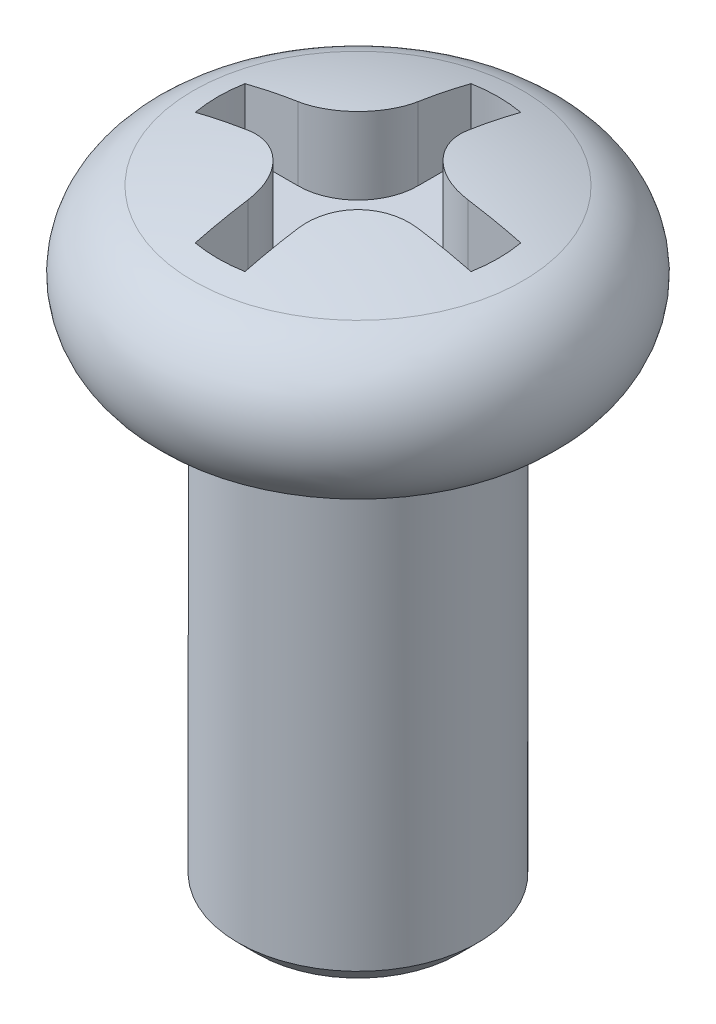
ISO-10303-21;
HEADER;
FILE_DESCRIPTION(('STEP AP214'),'2;1');
FILE_NAME('part.step','',(''),(''),'','','');
FILE_SCHEMA(('AUTOMOTIVE_DESIGN { 1 0 10303 214 1 1 1 1 }'));
ENDSEC;
DATA;
#1=APPLICATION_CONTEXT('core data for automotive mechanical design processes');
#2=APPLICATION_PROTOCOL_DEFINITION('international standard','automotive_design',2000,#1);
#3=PRODUCT_CONTEXT('',#1,'mechanical');
#4=PRODUCT('Part','Part','',(#3));
#5=PRODUCT_RELATED_PRODUCT_CATEGORY('part','',(#4));
#6=PRODUCT_DEFINITION_FORMATION('','',#4);
#7=PRODUCT_DEFINITION_CONTEXT('part definition',#1,'design');
#8=PRODUCT_DEFINITION('design','',#6,#7);
#9=PRODUCT_DEFINITION_SHAPE('','',#8);
#10=(LENGTH_UNIT() NAMED_UNIT(*) SI_UNIT(.MILLI.,.METRE.));
#11=(NAMED_UNIT(*) PLANE_ANGLE_UNIT() SI_UNIT($,.RADIAN.));
#12=(NAMED_UNIT(*) SI_UNIT($,.STERADIAN.) SOLID_ANGLE_UNIT());
#13=UNCERTAINTY_MEASURE_WITH_UNIT(LENGTH_MEASURE(1.E-05),#10,'distance_accuracy_value','');
#14=(GEOMETRIC_REPRESENTATION_CONTEXT(3) GLOBAL_UNCERTAINTY_ASSIGNED_CONTEXT((#13)) GLOBAL_UNIT_ASSIGNED_CONTEXT((#10,
#11,#12)) REPRESENTATION_CONTEXT('',''));
#15=CARTESIAN_POINT('',(0.,0.,0.));
#16=DIRECTION('',(0.,0.,1.));
#17=DIRECTION('',(1.,0.,0.));
#18=AXIS2_PLACEMENT_3D('',#15,#16,#17);
#19=CARTESIAN_POINT('',(0.,1.,0.));
#20=DIRECTION('',(0.,-1.,0.));
#21=DIRECTION('',(0.,0.,-1.));
#22=AXIS2_PLACEMENT_3D('',#19,#20,#21);
#23=PLANE('',#22);
#24=DIRECTION('',(0.,0.,1.));
#25=VECTOR('',#24,1.);
#26=CARTESIAN_POINT('',(-0.3106601717798,1.,1.722205056801));
#27=LINE('',#26,#25);
#28=CARTESIAN_POINT('',(-0.3106601717799,1.,1.06066017178));
#29=VERTEX_POINT('',#28);
#30=CARTESIAN_POINT('',(-0.3106601717798,1.,1.72220505680083));
#31=VERTEX_POINT('',#30);
#32=EDGE_CURVE('P0_E159',#29,#31,#27,.T.);
#33=ORIENTED_EDGE('',*,*,#32,.T.);
#34=CARTESIAN_POINT('',(0.,1.,0.));
#35=DIRECTION('',(0.,-1.,0.));
#36=DIRECTION('',(0.,0.,-1.));
#37=AXIS2_PLACEMENT_3D('',#34,#35,#36);
#38=CIRCLE('',#37,1.75);
#39=CARTESIAN_POINT('',(0.31066017177977,1.,1.72220505680066));
#40=VERTEX_POINT('',#39);
#41=EDGE_CURVE('P0_E231',#31,#40,#38,.F.);
#42=ORIENTED_EDGE('',*,*,#41,.T.);
#43=DIRECTION('',(0.,0.,-1.));
#44=VECTOR('',#43,1.);
#45=CARTESIAN_POINT('',(0.3106601717798,1.,1.06066017178));
#46=LINE('',#45,#44);
#47=CARTESIAN_POINT('',(0.3106601717798,1.,1.06066017178));
#48=VERTEX_POINT('',#47);
#49=EDGE_CURVE('P0_E163',#40,#48,#46,.T.);
#50=ORIENTED_EDGE('',*,*,#49,.T.);
#51=CARTESIAN_POINT('',(1.06066017178,1.,1.06066017178));
#52=DIRECTION('',(0.,-1.,0.));
#53=DIRECTION('',(0.,0.,-1.));
#54=AXIS2_PLACEMENT_3D('',#51,#52,#53);
#55=CIRCLE('',#54,0.75);
#56=CARTESIAN_POINT('',(1.06066017178,1.,0.3106601717799));
#57=VERTEX_POINT('',#56);
#58=EDGE_CURVE('P0_E166',#57,#48,#55,.F.);
#59=ORIENTED_EDGE('',*,*,#58,.F.);
#60=DIRECTION('',(1.,0.,0.));
#61=VECTOR('',#60,1.);
#62=CARTESIAN_POINT('',(1.722205056801,1.,0.3106601717798));
#63=LINE('',#62,#61);
#64=CARTESIAN_POINT('',(1.72220505680083,1.,0.3106601717798));
#65=VERTEX_POINT('',#64);
#66=EDGE_CURVE('P0_E167',#57,#65,#63,.T.);
#67=ORIENTED_EDGE('',*,*,#66,.T.);
#68=CARTESIAN_POINT('',(0.,1.,0.));
#69=DIRECTION('',(0.,-1.,0.));
#70=DIRECTION('',(0.,0.,-1.));
#71=AXIS2_PLACEMENT_3D('',#68,#69,#70);
#72=CIRCLE('',#71,1.75);
#73=CARTESIAN_POINT('',(1.72220505680066,1.,-0.31066017177977));
#74=VERTEX_POINT('',#73);
#75=EDGE_CURVE('P0_E242',#65,#74,#72,.F.);
#76=ORIENTED_EDGE('',*,*,#75,.T.);
#77=DIRECTION('',(-1.,0.,0.));
#78=VECTOR('',#77,1.);
#79=CARTESIAN_POINT('',(1.06066017178,1.,-0.3106601717798));
#80=LINE('',#79,#78);
#81=CARTESIAN_POINT('',(1.06066017178,1.,-0.3106601717798));
#82=VERTEX_POINT('',#81);
#83=EDGE_CURVE('P0_E171',#74,#82,#80,.T.);
#84=ORIENTED_EDGE('',*,*,#83,.T.);
#85=CARTESIAN_POINT('',(1.06066017178,1.,-1.06066017178));
#86=DIRECTION('',(0.,-1.,0.));
#87=DIRECTION('',(0.,0.,-1.));
#88=AXIS2_PLACEMENT_3D('',#85,#86,#87);
#89=CIRCLE('',#88,0.75);
#90=CARTESIAN_POINT('',(0.3106601717799,1.,-1.06066017178));
#91=VERTEX_POINT('',#90);
#92=EDGE_CURVE('P0_E174',#91,#82,#89,.F.);
#93=ORIENTED_EDGE('',*,*,#92,.F.);
#94=DIRECTION('',(0.,0.,-1.));
#95=VECTOR('',#94,1.);
#96=CARTESIAN_POINT('',(0.3106601717798,1.,-1.722205056801));
#97=LINE('',#96,#95);
#98=CARTESIAN_POINT('',(0.3106601717798,1.,-1.72220505680083));
#99=VERTEX_POINT('',#98);
#100=EDGE_CURVE('P0_E176',#91,#99,#97,.T.);
#101=ORIENTED_EDGE('',*,*,#100,.T.);
#102=CARTESIAN_POINT('',(0.,1.,0.));
#103=DIRECTION('',(0.,-1.,0.));
#104=DIRECTION('',(0.,0.,-1.));
#105=AXIS2_PLACEMENT_3D('',#102,#103,#104);
#106=CIRCLE('',#105,1.75);
#107=CARTESIAN_POINT('',(-0.31066017177977,1.,-1.72220505680066));
#108=VERTEX_POINT('',#107);
#109=EDGE_CURVE('P0_E135',#99,#108,#106,.F.);
#110=ORIENTED_EDGE('',*,*,#109,.T.);
#111=DIRECTION('',(0.,0.,1.));
#112=VECTOR('',#111,1.);
#113=CARTESIAN_POINT('',(-0.3106601717798,1.,-1.06066017178));
#114=LINE('',#113,#112);
#115=CARTESIAN_POINT('',(-0.3106601717798,1.,-1.06066017178));
#116=VERTEX_POINT('',#115);
#117=EDGE_CURVE('P0_E131',#108,#116,#114,.T.);
#118=ORIENTED_EDGE('',*,*,#117,.T.);
#119=CARTESIAN_POINT('',(-1.06066017178,1.,-1.06066017178));
#120=DIRECTION('',(0.,-1.,0.));
#121=DIRECTION('',(0.,0.,-1.));
#122=AXIS2_PLACEMENT_3D('',#119,#120,#121);
#123=CIRCLE('',#122,0.75);
#124=CARTESIAN_POINT('',(-1.06066017178,1.,-0.3106601717799));
#125=VERTEX_POINT('',#124);
#126=EDGE_CURVE('P0_E19',#125,#116,#123,.F.);
#127=ORIENTED_EDGE('',*,*,#126,.F.);
#128=DIRECTION('',(-1.,0.,0.));
#129=VECTOR('',#128,1.);
#130=CARTESIAN_POINT('',(-1.722205056801,1.,-0.3106601717798));
#131=LINE('',#130,#129);
#132=CARTESIAN_POINT('',(-1.72220505680066,1.,-0.31066017177977));
#133=VERTEX_POINT('',#132);
#134=EDGE_CURVE('P0_E126',#125,#133,#131,.T.);
#135=ORIENTED_EDGE('',*,*,#134,.T.);
#136=CARTESIAN_POINT('',(0.,1.,0.));
#137=DIRECTION('',(0.,-1.,0.));
#138=DIRECTION('',(0.,0.,-1.));
#139=AXIS2_PLACEMENT_3D('',#136,#137,#138);
#140=CIRCLE('',#139,1.75);
#141=CARTESIAN_POINT('',(-1.72220505680083,1.,0.3106601717798));
#142=VERTEX_POINT('',#141);
#143=EDGE_CURVE('P0_E239',#133,#142,#140,.F.);
#144=ORIENTED_EDGE('',*,*,#143,.T.);
#145=DIRECTION('',(1.,0.,0.));
#146=VECTOR('',#145,1.);
#147=CARTESIAN_POINT('',(-1.06066017178,1.,0.3106601717798));
#148=LINE('',#147,#146);
#149=CARTESIAN_POINT('',(-1.06066017178,1.,0.3106601717798));
#150=VERTEX_POINT('',#149);
#151=EDGE_CURVE('P0_E156',#142,#150,#148,.T.);
#152=ORIENTED_EDGE('',*,*,#151,.T.);
#153=CARTESIAN_POINT('',(-1.06066017178,1.,1.06066017178));
#154=DIRECTION('',(0.,-1.,0.));
#155=DIRECTION('',(0.,0.,-1.));
#156=AXIS2_PLACEMENT_3D('',#153,#154,#155);
#157=CIRCLE('',#156,0.75);
#158=EDGE_CURVE('P0_E225',#29,#150,#157,.F.);
#159=ORIENTED_EDGE('',*,*,#158,.F.);
#160=EDGE_LOOP('',(#33,#42,#50,#59,#67,#76,#84,#93,#101,#110,#118,#127,#135,#144,#152,#159));
#161=FACE_BOUND('',#160,.T.);
#162=ADVANCED_FACE('P0_F16',(#161),#23,.F.);
#163=CARTESIAN_POINT('',(-1.722205056801,1.,-0.3106601717798));
#164=DIRECTION('',(0.,0.,-1.));
#165=DIRECTION('',(-1.,0.,0.));
#166=AXIS2_PLACEMENT_3D('',#163,#164,#165);
#167=PLANE('',#166);
#168=ORIENTED_EDGE('',*,*,#134,.F.);
#169=DIRECTION('',(0.,-1.,0.));
#170=VECTOR('',#169,1.);
#171=CARTESIAN_POINT('',(-1.06066017178,1.,-0.31066017178));
#172=LINE('',#171,#170);
#173=CARTESIAN_POINT('',(-1.06066017177999,1.91090964979495,-0.310660171779999));
#174=VERTEX_POINT('',#173);
#175=EDGE_CURVE('P0_E145',#174,#125,#172,.T.);
#176=ORIENTED_EDGE('',*,*,#175,.F.);
#177=CARTESIAN_POINT('',(-1.72220505680088,1.77439135801904,-0.310660171779798));
#178=CARTESIAN_POINT('',(-1.61306309558163,1.80255002876349,-0.3106601717798));
#179=CARTESIAN_POINT('',(-1.5033633745536,1.82800588845038,-0.3106601717798));
#180=CARTESIAN_POINT('',(-1.28284841287997,1.873511985709,-0.3106601717798));
#181=CARTESIAN_POINT('',(-1.17203317223437,1.89356222328074,-0.310660171779798));
#182=CARTESIAN_POINT('',(-1.06066017177999,1.91090964979491,-0.310660171779796));
#183=B_SPLINE_CURVE_WITH_KNOTS('',3,(#177,#178,#179,#180,#181,#182),.UNSPECIFIED.,.F.,.F.,(4,2,
4),(0.,0.33784355295644,0.67568710591288),.UNSPECIFIED.);
#184=CARTESIAN_POINT('',(-1.72220505680077,1.77439135801902,-0.310660171779769));
#185=VERTEX_POINT('',#184);
#186=EDGE_CURVE('P0_E222',#185,#174,#183,.T.);
#187=ORIENTED_EDGE('',*,*,#186,.F.);
#188=DIRECTION('',(0.,-1.,0.));
#189=VECTOR('',#188,1.);
#190=CARTESIAN_POINT('',(-1.72220505680067,1.,-0.31066017177974));
#191=LINE('',#190,#189);
#192=EDGE_CURVE('P0_E237',#185,#133,#191,.T.);
#193=ORIENTED_EDGE('',*,*,#192,.T.);
#194=EDGE_LOOP('',(#168,#176,#187,#193));
#195=FACE_BOUND('',#194,.T.);
#196=ADVANCED_FACE('P0_F280',(#195),#167,.F.);
#197=CARTESIAN_POINT('',(-1.06066017178,1.,-1.06066017178));
#198=DIRECTION('',(0.,-1.,0.));
#199=DIRECTION('',(0.,0.,-1.));
#200=AXIS2_PLACEMENT_3D('',#197,#198,#199);
#201=CYLINDRICAL_SURFACE('',#200,0.75);
#202=DIRECTION('',(0.,1.,0.));
#203=VECTOR('',#202,1.);
#204=CARTESIAN_POINT('',(-0.3106601717798,1.,-1.06066017178));
#205=LINE('',#204,#203);
#206=CARTESIAN_POINT('',(-0.3106601717798,1.91090964979495,-1.06066017178));
#207=VERTEX_POINT('',#206);
#208=EDGE_CURVE('P0_E139',#116,#207,#205,.T.);
#209=ORIENTED_EDGE('',*,*,#208,.T.);
#210=CARTESIAN_POINT('',(-1.06066017177998,1.9109096497949,-0.310660171779997));
#211=CARTESIAN_POINT('',(-1.01919398648515,1.91737285226506,-0.310622939610314));
#212=CARTESIAN_POINT('',(-0.977639574393047,1.92329389693845,-0.314097480559706));
#213=CARTESIAN_POINT('',(-0.89552793577624,1.9339054188609,-0.327891873911088));
#214=CARTESIAN_POINT('',(-0.854970577087562,1.93859606001134,-0.33821081392745));
#215=CARTESIAN_POINT('',(-0.775975780143731,1.94660630127969,-0.365529421696837));
#216=CARTESIAN_POINT('',(-0.737540488476249,1.94992453437821,-0.382535717823382));
#217=CARTESIAN_POINT('',(-0.663986798206151,1.95508207214637,-0.422768684888768));
#218=CARTESIAN_POINT('',(-0.628866995291569,1.95692200546903,-0.445992706106923));
#219=CARTESIAN_POINT('',(-0.56339009730392,1.95905391047029,-0.49768518650704));
#220=CARTESIAN_POINT('',(-0.532978760843824,1.95936501960633,-0.526084168859353));
#221=CARTESIAN_POINT('',(-0.477273782501635,1.95848159980138,-0.58750191243474));
#222=CARTESIAN_POINT('',(-0.451980011342345,1.95728710889956,-0.620520556922729));
#223=CARTESIAN_POINT('',(-0.407347195185679,1.95344064774051,-0.690014136925466));
#224=CARTESIAN_POINT('',(-0.387975080904388,1.95079701072087,-0.726468333203357));
#225=CARTESIAN_POINT('',(-0.355496615735851,1.94413592237402,-0.801949736200293));
#226=CARTESIAN_POINT('',(-0.342388857988036,1.94011877985913,-0.840976362955746));
#227=CARTESIAN_POINT('',(-0.32527219723243,1.93202883522993,-0.910228995668488));
#228=CARTESIAN_POINT('',(-0.319789515730464,1.92823668158531,-0.940133694348949));
#229=CARTESIAN_POINT('',(-0.31248252687447,1.92002737932689,-1.00025806578418));
#230=CARTESIAN_POINT('',(-0.310652972676462,1.9156111368504,-1.03047722404984));
#231=CARTESIAN_POINT('',(-0.310660171779999,1.9109096497949,-1.06066017177998));
#232=B_SPLINE_CURVE_WITH_KNOTS('',3,(#210,#211,#212,#213,#214,#215,#216,#217,#218,#219,#220,
#221,#222,#223,#224,#225,#226,#227,#228,#229,#230,#231),.UNSPECIFIED.,.F.,.F.,(4,2,2,2,2,2,2,2,
2,2,4),(0.,0.125759280195427,0.25150179954673,0.377369267798946,0.503183182023199,
0.627418103733702,0.751649886696141,0.875174663537585,0.998671685908747,1.09037087197334,
1.18193825907195),.UNSPECIFIED.);
#233=EDGE_CURVE('P0_E264',#174,#207,#232,.T.);
#234=ORIENTED_EDGE('',*,*,#233,.F.);
#235=ORIENTED_EDGE('',*,*,#175,.T.);
#236=ORIENTED_EDGE('',*,*,#126,.T.);
#237=EDGE_LOOP('',(#209,#234,#235,#236));
#238=FACE_BOUND('',#237,.T.);
#239=ADVANCED_FACE('P0_F142',(#238),#201,.T.);
#240=CARTESIAN_POINT('',(-0.3106601717798,1.,-1.06066017178));
#241=DIRECTION('',(-1.,0.,0.));
#242=DIRECTION('',(0.,0.,1.));
#243=AXIS2_PLACEMENT_3D('',#240,#241,#242);
#244=PLANE('',#243);
#245=ORIENTED_EDGE('',*,*,#117,.F.);
#246=DIRECTION('',(0.,-1.,0.));
#247=VECTOR('',#246,1.);
#248=CARTESIAN_POINT('',(-0.310660171779741,1.,-1.72220505680067));
#249=LINE('',#248,#247);
#250=CARTESIAN_POINT('',(-0.3106601717798,1.77439135801905,-1.72220505680075));
#251=VERTEX_POINT('',#250);
#252=EDGE_CURVE('P0_E151',#108,#251,#249,.F.);
#253=ORIENTED_EDGE('',*,*,#252,.T.);
#254=CARTESIAN_POINT('',(-0.3106601717798,-4.9,0.));
#255=DIRECTION('',(-1.,0.,0.));
#256=DIRECTION('',(0.,0.,1.));
#257=AXIS2_PLACEMENT_3D('',#254,#255,#256);
#258=CIRCLE('',#257,6.89300299272166);
#259=EDGE_CURVE('P0_E148',#207,#251,#258,.T.);
#260=ORIENTED_EDGE('',*,*,#259,.F.);
#261=ORIENTED_EDGE('',*,*,#208,.F.);
#262=EDGE_LOOP('',(#245,#253,#260,#261));
#263=FACE_BOUND('',#262,.T.);
#264=ADVANCED_FACE('P0_F146',(#263),#244,.F.);
#265=CARTESIAN_POINT('',(0.,1.,0.));
#266=DIRECTION('',(0.,-1.,0.));
#267=DIRECTION('',(0.,0.,-1.));
#268=AXIS2_PLACEMENT_3D('',#265,#266,#267);
#269=CYLINDRICAL_SURFACE('',#268,1.75);
#270=ORIENTED_EDGE('',*,*,#109,.F.);
#271=DIRECTION('',(0.,1.,0.));
#272=VECTOR('',#271,1.);
#273=CARTESIAN_POINT('',(0.3106601717798,1.,-1.722205056801));
#274=LINE('',#273,#272);
#275=CARTESIAN_POINT('',(0.310660171779799,1.774391358019,-1.72220505680092));
#276=VERTEX_POINT('',#275);
#277=EDGE_CURVE('P0_E177',#99,#276,#274,.T.);
#278=ORIENTED_EDGE('',*,*,#277,.T.);
#279=CARTESIAN_POINT('',(0.,1.774391358019,0.));
#280=DIRECTION('',(0.,-1.,0.));
#281=DIRECTION('',(0.,0.,-1.));
#282=AXIS2_PLACEMENT_3D('',#279,#280,#281);
#283=CIRCLE('',#282,1.75);
#284=EDGE_CURVE('P0_E252',#251,#276,#283,.T.);
#285=ORIENTED_EDGE('',*,*,#284,.F.);
#286=ORIENTED_EDGE('',*,*,#252,.F.);
#287=EDGE_LOOP('',(#270,#278,#285,#286));
#288=FACE_BOUND('',#287,.T.);
#289=ADVANCED_FACE('P0_F250',(#288),#269,.F.);
#290=CARTESIAN_POINT('',(0.3106601717798,1.,-1.722205056801));
#291=DIRECTION('',(1.,0.,0.));
#292=DIRECTION('',(0.,0.,-1.));
#293=AXIS2_PLACEMENT_3D('',#290,#291,#292);
#294=PLANE('',#293);
#295=ORIENTED_EDGE('',*,*,#100,.F.);
#296=DIRECTION('',(0.,-1.,0.));
#297=VECTOR('',#296,1.);
#298=CARTESIAN_POINT('',(0.31066017178,1.,-1.06066017178));
#299=LINE('',#298,#297);
#300=CARTESIAN_POINT('',(0.310660171779899,1.91090964979495,-1.06066017178));
#301=VERTEX_POINT('',#300);
#302=EDGE_CURVE('P0_E244',#301,#91,#299,.T.);
#303=ORIENTED_EDGE('',*,*,#302,.F.);
#304=CARTESIAN_POINT('',(0.310660171779799,-4.9,0.));
#305=DIRECTION('',(-1.,0.,0.));
#306=DIRECTION('',(0.,0.,1.));
#307=AXIS2_PLACEMENT_3D('',#304,#305,#306);
#308=CIRCLE('',#307,6.89300299272166);
#309=EDGE_CURVE('P0_E255',#276,#301,#308,.F.);
#310=ORIENTED_EDGE('',*,*,#309,.F.);
#311=ORIENTED_EDGE('',*,*,#277,.F.);
#312=EDGE_LOOP('',(#295,#303,#310,#311));
#313=FACE_BOUND('',#312,.T.);
#314=ADVANCED_FACE('P0_F256',(#313),#294,.F.);
#315=CARTESIAN_POINT('',(1.06066017178,1.,-1.06066017178));
#316=DIRECTION('',(0.,-1.,0.));
#317=DIRECTION('',(0.,0.,-1.));
#318=AXIS2_PLACEMENT_3D('',#315,#316,#317);
#319=CYLINDRICAL_SURFACE('',#318,0.75);
#320=DIRECTION('',(0.,1.,0.));
#321=VECTOR('',#320,1.);
#322=CARTESIAN_POINT('',(1.06066017178,1.,-0.3106601717798));
#323=LINE('',#322,#321);
#324=CARTESIAN_POINT('',(1.06066017177999,1.91090964979495,-0.310660171779798));
#325=VERTEX_POINT('',#324);
#326=EDGE_CURVE('P0_E173',#82,#325,#323,.T.);
#327=ORIENTED_EDGE('',*,*,#326,.T.);
#328=CARTESIAN_POINT('',(0.31066017178,1.9109096497949,-1.06066017177998));
#329=CARTESIAN_POINT('',(0.310622939610315,1.91737285226506,-1.01919398648515));
#330=CARTESIAN_POINT('',(0.314097480559706,1.92329389693845,-0.977639574393049));
#331=CARTESIAN_POINT('',(0.327891873911087,1.9339054188609,-0.895527935776246));
#332=CARTESIAN_POINT('',(0.338210813927448,1.93859606001134,-0.85497057708757));
#333=CARTESIAN_POINT('',(0.365529421696833,1.94660630127969,-0.775975780143742));
#334=CARTESIAN_POINT('',(0.382535717823376,1.9499245343782,-0.737540488476261));
#335=CARTESIAN_POINT('',(0.422768684888759,1.95508207214636,-0.663986798206166));
#336=CARTESIAN_POINT('',(0.445992706106912,1.95692200546903,-0.628866995291585));
#337=CARTESIAN_POINT('',(0.497685186507026,1.95905391047029,-0.563390097303936));
#338=CARTESIAN_POINT('',(0.526084168859338,1.95936501960633,-0.53297876084384));
#339=CARTESIAN_POINT('',(0.587501912434723,1.95848159980138,-0.477273782501648));
#340=CARTESIAN_POINT('',(0.620520556922711,1.95728710889957,-0.451980011342356));
#341=CARTESIAN_POINT('',(0.690014136925447,1.95344064774051,-0.407347195185688));
#342=CARTESIAN_POINT('',(0.726468333203338,1.95079701072088,-0.387975080904397));
#343=CARTESIAN_POINT('',(0.801949736200273,1.94413592237402,-0.35549661573586));
#344=CARTESIAN_POINT('',(0.840976362955726,1.94011877985913,-0.342388857988044));
#345=CARTESIAN_POINT('',(0.91022899566847,1.93202883522993,-0.325272197232435));
#346=CARTESIAN_POINT('',(0.940133694348936,1.92823668158531,-0.319789515730467));
#347=CARTESIAN_POINT('',(1.00025806578417,1.92002737932689,-0.312482526874469));
#348=CARTESIAN_POINT('',(1.03047722404984,1.9156111368504,-0.310652972676461));
#349=CARTESIAN_POINT('',(1.06066017177998,1.9109096497949,-0.310660171779998));
#350=B_SPLINE_CURVE_WITH_KNOTS('',3,(#328,#329,#330,#331,#332,#333,#334,#335,#336,#337,#338,
#339,#340,#341,#342,#343,#344,#345,#346,#347,#348,#349),.UNSPECIFIED.,.F.,.F.,(4,2,2,2,2,2,2,2,
2,2,4),(0.,0.125759280195421,0.251501799546719,0.377369267798928,0.503183182023175,
0.627418103733679,0.751649886696118,0.875174663537562,0.998671685908723,1.09037087197333,
1.18193825907195),.UNSPECIFIED.);
#351=EDGE_CURVE('P0_E260',#301,#325,#350,.T.);
#352=ORIENTED_EDGE('',*,*,#351,.F.);
#353=ORIENTED_EDGE('',*,*,#302,.T.);
#354=ORIENTED_EDGE('',*,*,#92,.T.);
#355=EDGE_LOOP('',(#327,#352,#353,#354));
#356=FACE_BOUND('',#355,.T.);
#357=ADVANCED_FACE('P0_F399',(#356),#319,.T.);
#358=CARTESIAN_POINT('',(1.06066017178,1.,-0.3106601717798));
#359=DIRECTION('',(0.,0.,-1.));
#360=DIRECTION('',(-1.,0.,0.));
#361=AXIS2_PLACEMENT_3D('',#358,#359,#360);
#362=PLANE('',#361);
#363=ORIENTED_EDGE('',*,*,#83,.F.);
#364=DIRECTION('',(0.,-1.,0.));
#365=VECTOR('',#364,1.);
#366=CARTESIAN_POINT('',(1.72220505680067,1.,-0.31066017177974));
#367=LINE('',#366,#365);
#368=CARTESIAN_POINT('',(1.72220505680066,1.774391358019,-0.31066017177977));
#369=VERTEX_POINT('',#368);
#370=EDGE_CURVE('P0_E170',#74,#369,#367,.F.);
#371=ORIENTED_EDGE('',*,*,#370,.T.);
#372=CARTESIAN_POINT('',(1.06066017177999,1.91090964979491,-0.310660171779797));
#373=CARTESIAN_POINT('',(1.17203317223437,1.89356222328074,-0.310660171779799));
#374=CARTESIAN_POINT('',(1.28284841287997,1.873511985709,-0.3106601717798));
#375=CARTESIAN_POINT('',(1.5033633745536,1.82800588845038,-0.3106601717798));
#376=CARTESIAN_POINT('',(1.61306309558163,1.80255002876349,-0.310660171779799));
#377=CARTESIAN_POINT('',(1.72220505680088,1.77439135801904,-0.310660171779797));
#378=B_SPLINE_CURVE_WITH_KNOTS('',3,(#372,#373,#374,#375,#376,#377),.UNSPECIFIED.,.F.,.F.,(4,2,
4),(0.,0.33784355295644,0.675687105912881),.UNSPECIFIED.);
#379=EDGE_CURVE('P0_E505',#325,#369,#378,.T.);
#380=ORIENTED_EDGE('',*,*,#379,.F.);
#381=ORIENTED_EDGE('',*,*,#326,.F.);
#382=EDGE_LOOP('',(#363,#371,#380,#381));
#383=FACE_BOUND('',#382,.T.);
#384=ADVANCED_FACE('P0_F391',(#383),#362,.F.);
#385=CARTESIAN_POINT('',(0.,1.,0.));
#386=DIRECTION('',(0.,-1.,0.));
#387=DIRECTION('',(0.,0.,-1.));
#388=AXIS2_PLACEMENT_3D('',#385,#386,#387);
#389=CYLINDRICAL_SURFACE('',#388,1.75);
#390=ORIENTED_EDGE('',*,*,#143,.F.);
#391=ORIENTED_EDGE('',*,*,#192,.F.);
#392=CARTESIAN_POINT('',(0.,1.774391358019,0.));
#393=DIRECTION('',(0.,-1.,0.));
#394=DIRECTION('',(0.,0.,-1.));
#395=AXIS2_PLACEMENT_3D('',#392,#393,#394);
#396=CIRCLE('',#395,1.75);
#397=CARTESIAN_POINT('',(-1.72220505680083,1.774391358019,0.3106601717798));
#398=VERTEX_POINT('',#397);
#399=EDGE_CURVE('P0_E511',#398,#185,#396,.T.);
#400=ORIENTED_EDGE('',*,*,#399,.F.);
#401=DIRECTION('',(0.,1.,0.));
#402=VECTOR('',#401,1.);
#403=CARTESIAN_POINT('',(-1.722205056801,1.,0.3106601717798));
#404=LINE('',#403,#402);
#405=EDGE_CURVE('P0_E158',#398,#142,#404,.F.);
#406=ORIENTED_EDGE('',*,*,#405,.T.);
#407=EDGE_LOOP('',(#390,#391,#400,#406));
#408=FACE_BOUND('',#407,.T.);
#409=ADVANCED_FACE('P0_F383',(#408),#389,.F.);
#410=CARTESIAN_POINT('',(0.,1.,0.));
#411=DIRECTION('',(0.,-1.,0.));
#412=DIRECTION('',(0.,0.,-1.));
#413=AXIS2_PLACEMENT_3D('',#410,#411,#412);
#414=CYLINDRICAL_SURFACE('',#413,1.75);
#415=ORIENTED_EDGE('',*,*,#370,.F.);
#416=ORIENTED_EDGE('',*,*,#75,.F.);
#417=DIRECTION('',(0.,1.,0.));
#418=VECTOR('',#417,1.);
#419=CARTESIAN_POINT('',(1.722205056801,1.,0.3106601717798));
#420=LINE('',#419,#418);
#421=CARTESIAN_POINT('',(1.72220505680097,1.77439135801901,0.3106601717798));
#422=VERTEX_POINT('',#421);
#423=EDGE_CURVE('P0_E169',#65,#422,#420,.T.);
#424=ORIENTED_EDGE('',*,*,#423,.T.);
#425=CARTESIAN_POINT('',(0.,1.774391358019,0.));
#426=DIRECTION('',(0.,-1.,0.));
#427=DIRECTION('',(0.,0.,-1.));
#428=AXIS2_PLACEMENT_3D('',#425,#426,#427);
#429=CIRCLE('',#428,1.75);
#430=EDGE_CURVE('P0_E513',#369,#422,#429,.T.);
#431=ORIENTED_EDGE('',*,*,#430,.F.);
#432=EDGE_LOOP('',(#415,#416,#424,#431));
#433=FACE_BOUND('',#432,.T.);
#434=ADVANCED_FACE('P0_F375',(#433),#414,.F.);
#435=CARTESIAN_POINT('',(1.722205056801,1.,0.3106601717798));
#436=DIRECTION('',(0.,0.,1.));
#437=DIRECTION('',(1.,0.,0.));
#438=AXIS2_PLACEMENT_3D('',#435,#436,#437);
#439=PLANE('',#438);
#440=ORIENTED_EDGE('',*,*,#66,.F.);
#441=DIRECTION('',(0.,-1.,0.));
#442=VECTOR('',#441,1.);
#443=CARTESIAN_POINT('',(1.06066017178,1.,0.31066017178));
#444=LINE('',#443,#442);
#445=CARTESIAN_POINT('',(1.06066017177999,1.91090964979495,0.310660171780001));
#446=VERTEX_POINT('',#445);
#447=EDGE_CURVE('P0_E233',#446,#57,#444,.T.);
#448=ORIENTED_EDGE('',*,*,#447,.F.);
#449=CARTESIAN_POINT('',(1.72220505680094,1.77439135801902,0.310660171779801));
#450=CARTESIAN_POINT('',(1.61306309558168,1.80255002876348,0.3106601717798));
#451=CARTESIAN_POINT('',(1.50336337455365,1.82800588845037,0.3106601717798));
#452=CARTESIAN_POINT('',(1.28284841288,1.873511985709,0.3106601717798));
#453=CARTESIAN_POINT('',(1.17203317223438,1.89356222328074,0.310660171779801));
#454=CARTESIAN_POINT('',(1.06066017177999,1.91090964979491,0.310660171779802));
#455=B_SPLINE_CURVE_WITH_KNOTS('',3,(#449,#450,#451,#452,#453,#454),.UNSPECIFIED.,.F.,.F.,(4,2,
4),(0.,0.337843552956472,0.675687105912945),.UNSPECIFIED.);
#456=EDGE_CURVE('P0_E515',#422,#446,#455,.T.);
#457=ORIENTED_EDGE('',*,*,#456,.F.);
#458=ORIENTED_EDGE('',*,*,#423,.F.);
#459=EDGE_LOOP('',(#440,#448,#457,#458));
#460=FACE_BOUND('',#459,.T.);
#461=ADVANCED_FACE('P0_F367',(#460),#439,.F.);
#462=CARTESIAN_POINT('',(1.06066017178,1.,1.06066017178));
#463=DIRECTION('',(0.,-1.,0.));
#464=DIRECTION('',(0.,0.,-1.));
#465=AXIS2_PLACEMENT_3D('',#462,#463,#464);
#466=CYLINDRICAL_SURFACE('',#465,0.75);
#467=DIRECTION('',(0.,1.,0.));
#468=VECTOR('',#467,1.);
#469=CARTESIAN_POINT('',(0.3106601717798,1.,1.06066017178));
#470=LINE('',#469,#468);
#471=CARTESIAN_POINT('',(0.310660171779799,1.91090964979495,1.06066017178));
#472=VERTEX_POINT('',#471);
#473=EDGE_CURVE('P0_E165',#48,#472,#470,.T.);
#474=ORIENTED_EDGE('',*,*,#473,.T.);
#475=CARTESIAN_POINT('',(1.06066017177998,1.9109096497949,0.310660171780001));
#476=CARTESIAN_POINT('',(1.01919398648515,1.91737285226506,0.310622939610313));
#477=CARTESIAN_POINT('',(0.977639574393047,1.92329389693845,0.314097480559705));
#478=CARTESIAN_POINT('',(0.89552793577624,1.9339054188609,0.327891873911089));
#479=CARTESIAN_POINT('',(0.854970577087563,1.93859606001134,0.338210813927453));
#480=CARTESIAN_POINT('',(0.775975780143732,1.94660630127969,0.365529421696841));
#481=CARTESIAN_POINT('',(0.737540488476249,1.94992453437821,0.382535717823383));
#482=CARTESIAN_POINT('',(0.66398679820615,1.95508207214636,0.422768684888768));
#483=CARTESIAN_POINT('',(0.628866995291568,1.95692200546903,0.445992706106925));
#484=CARTESIAN_POINT('',(0.56339009730392,1.95905391047029,0.497685186507042));
#485=CARTESIAN_POINT('',(0.532978760843824,1.95936501960633,0.526084168859354));
#486=CARTESIAN_POINT('',(0.477273782501635,1.95848159980138,0.587501912434738));
#487=CARTESIAN_POINT('',(0.451980011342344,1.95728710889956,0.620520556922726));
#488=CARTESIAN_POINT('',(0.407347195185677,1.95344064774051,0.690014136925462));
#489=CARTESIAN_POINT('',(0.387975080904388,1.95079701072088,0.726468333203355));
#490=CARTESIAN_POINT('',(0.355496615735852,1.94413592237402,0.801949736200294));
#491=CARTESIAN_POINT('',(0.342388857988037,1.94011877985913,0.840976362955748));
#492=CARTESIAN_POINT('',(0.32527219723243,1.93202883522993,0.91022899566849));
#493=CARTESIAN_POINT('',(0.319789515730464,1.92823668158531,0.940133694348952));
#494=CARTESIAN_POINT('',(0.312482526874469,1.92002737932689,1.00025806578418));
#495=CARTESIAN_POINT('',(0.310652972676462,1.9156111368504,1.03047722404985));
#496=CARTESIAN_POINT('',(0.31066017178,1.9109096497949,1.06066017177999));
#497=B_SPLINE_CURVE_WITH_KNOTS('',3,(#475,#476,#477,#478,#479,#480,#481,#482,#483,#484,#485,
#486,#487,#488,#489,#490,#491,#492,#493,#494,#495,#496),.UNSPECIFIED.,.F.,.F.,(4,2,2,2,2,2,2,2,
2,2,4),(0.,0.125759280195427,0.251501799546731,0.377369267798946,0.5031831820232,
0.627418103733702,0.751649886696138,0.875174663537584,0.998671685908749,1.09037087197335,
1.18193825907195),.UNSPECIFIED.);
#498=EDGE_CURVE('P0_E521',#446,#472,#497,.T.);
#499=ORIENTED_EDGE('',*,*,#498,.F.);
#500=ORIENTED_EDGE('',*,*,#447,.T.);
#501=ORIENTED_EDGE('',*,*,#58,.T.);
#502=EDGE_LOOP('',(#474,#499,#500,#501));
#503=FACE_BOUND('',#502,.T.);
#504=ADVANCED_FACE('P0_F359',(#503),#466,.T.);
#505=CARTESIAN_POINT('',(0.3106601717798,1.,1.06066017178));
#506=DIRECTION('',(1.,0.,0.));
#507=DIRECTION('',(0.,0.,-1.));
#508=AXIS2_PLACEMENT_3D('',#505,#506,#507);
#509=PLANE('',#508);
#510=ORIENTED_EDGE('',*,*,#49,.F.);
#511=DIRECTION('',(0.,-1.,0.));
#512=VECTOR('',#511,1.);
#513=CARTESIAN_POINT('',(0.31066017177974,1.,1.72220505680067));
#514=LINE('',#513,#512);
#515=CARTESIAN_POINT('',(0.310660171779799,1.77439135801905,1.72220505680075));
#516=VERTEX_POINT('',#515);
#517=EDGE_CURVE('P0_E162',#40,#516,#514,.F.);
#518=ORIENTED_EDGE('',*,*,#517,.T.);
#519=CARTESIAN_POINT('',(0.310660171779799,-4.9,0.));
#520=DIRECTION('',(-1.,0.,0.));
#521=DIRECTION('',(0.,0.,1.));
#522=AXIS2_PLACEMENT_3D('',#519,#520,#521);
#523=CIRCLE('',#522,6.89300299272166);
#524=EDGE_CURVE('P0_E530',#472,#516,#523,.F.);
#525=ORIENTED_EDGE('',*,*,#524,.F.);
#526=ORIENTED_EDGE('',*,*,#473,.F.);
#527=EDGE_LOOP('',(#510,#518,#525,#526));
#528=FACE_BOUND('',#527,.T.);
#529=ADVANCED_FACE('P0_F351',(#528),#509,.F.);
#530=CARTESIAN_POINT('',(0.,1.,0.));
#531=DIRECTION('',(0.,-1.,0.));
#532=DIRECTION('',(0.,0.,-1.));
#533=AXIS2_PLACEMENT_3D('',#530,#531,#532);
#534=CYLINDRICAL_SURFACE('',#533,1.75);
#535=ORIENTED_EDGE('',*,*,#41,.F.);
#536=DIRECTION('',(0.,1.,0.));
#537=VECTOR('',#536,1.);
#538=CARTESIAN_POINT('',(-0.3106601717798,1.,1.722205056801));
#539=LINE('',#538,#537);
#540=CARTESIAN_POINT('',(-0.3106601717798,1.774391358019,1.72220505680092));
#541=VERTEX_POINT('',#540);
#542=EDGE_CURVE('P0_E161',#31,#541,#539,.T.);
#543=ORIENTED_EDGE('',*,*,#542,.T.);
#544=CARTESIAN_POINT('',(0.,1.774391358019,0.));
#545=DIRECTION('',(0.,-1.,0.));
#546=DIRECTION('',(0.,0.,-1.));
#547=AXIS2_PLACEMENT_3D('',#544,#545,#546);
#548=CIRCLE('',#547,1.75);
#549=EDGE_CURVE('P0_E533',#516,#541,#548,.T.);
#550=ORIENTED_EDGE('',*,*,#549,.F.);
#551=ORIENTED_EDGE('',*,*,#517,.F.);
#552=EDGE_LOOP('',(#535,#543,#550,#551));
#553=FACE_BOUND('',#552,.T.);
#554=ADVANCED_FACE('P0_F343',(#553),#534,.F.);
#555=CARTESIAN_POINT('',(-0.3106601717798,1.,1.722205056801));
#556=DIRECTION('',(-1.,0.,0.));
#557=DIRECTION('',(0.,0.,1.));
#558=AXIS2_PLACEMENT_3D('',#555,#556,#557);
#559=PLANE('',#558);
#560=ORIENTED_EDGE('',*,*,#32,.F.);
#561=DIRECTION('',(0.,-1.,0.));
#562=VECTOR('',#561,1.);
#563=CARTESIAN_POINT('',(-0.31066017178,1.,1.06066017178));
#564=LINE('',#563,#562);
#565=CARTESIAN_POINT('',(-0.3106601717799,1.91090964979495,1.06066017178));
#566=VERTEX_POINT('',#565);
#567=EDGE_CURVE('P0_E226',#566,#29,#564,.T.);
#568=ORIENTED_EDGE('',*,*,#567,.F.);
#569=CARTESIAN_POINT('',(-0.3106601717798,-4.9,0.));
#570=DIRECTION('',(-1.,0.,0.));
#571=DIRECTION('',(0.,0.,1.));
#572=AXIS2_PLACEMENT_3D('',#569,#570,#571);
#573=CIRCLE('',#572,6.89300299272166);
#574=EDGE_CURVE('P0_E535',#541,#566,#573,.T.);
#575=ORIENTED_EDGE('',*,*,#574,.F.);
#576=ORIENTED_EDGE('',*,*,#542,.F.);
#577=EDGE_LOOP('',(#560,#568,#575,#576));
#578=FACE_BOUND('',#577,.T.);
#579=ADVANCED_FACE('P0_F337',(#578),#559,.F.);
#580=CARTESIAN_POINT('',(-1.06066017178,1.,1.06066017178));
#581=DIRECTION('',(0.,-1.,0.));
#582=DIRECTION('',(0.,0.,-1.));
#583=AXIS2_PLACEMENT_3D('',#580,#581,#582);
#584=CYLINDRICAL_SURFACE('',#583,0.75);
#585=DIRECTION('',(0.,1.,0.));
#586=VECTOR('',#585,1.);
#587=CARTESIAN_POINT('',(-1.06066017178,1.,0.3106601717798));
#588=LINE('',#587,#586);
#589=CARTESIAN_POINT('',(-1.06066017177999,1.91090964979495,0.310660171779801));
#590=VERTEX_POINT('',#589);
#591=EDGE_CURVE('P0_E34',#150,#590,#588,.T.);
#592=ORIENTED_EDGE('',*,*,#591,.T.);
#593=CARTESIAN_POINT('',(-0.310660171779999,1.9109096497949,1.06066017177999));
#594=CARTESIAN_POINT('',(-0.310622939610314,1.91737285226506,1.01919398648515));
#595=CARTESIAN_POINT('',(-0.314097480559706,1.92329389693845,0.977639574393052));
#596=CARTESIAN_POINT('',(-0.327891873911086,1.9339054188609,0.895527935776248));
#597=CARTESIAN_POINT('',(-0.338210813927447,1.93859606001134,0.854970577087572));
#598=CARTESIAN_POINT('',(-0.365529421696833,1.94660630127969,0.775975780143745));
#599=CARTESIAN_POINT('',(-0.382535717823375,1.9499245343782,0.737540488476264));
#600=CARTESIAN_POINT('',(-0.422768684888758,1.95508207214636,0.663986798206168));
#601=CARTESIAN_POINT('',(-0.445992706106911,1.95692200546903,0.628866995291587));
#602=CARTESIAN_POINT('',(-0.497685186507025,1.95905391047029,0.563390097303938));
#603=CARTESIAN_POINT('',(-0.526084168859337,1.95936501960633,0.532978760843841));
#604=CARTESIAN_POINT('',(-0.587501912434721,1.95848159980138,0.47727378250165));
#605=CARTESIAN_POINT('',(-0.620520556922709,1.95728710889957,0.451980011342359));
#606=CARTESIAN_POINT('',(-0.690014136925444,1.95344064774051,0.40734719518569));
#607=CARTESIAN_POINT('',(-0.726468333203335,1.95079701072088,0.387975080904398));
#608=CARTESIAN_POINT('',(-0.80194973620027,1.94413592237402,0.355496615735861));
#609=CARTESIAN_POINT('',(-0.840976362955724,1.94011877985913,0.342388857988047));
#610=CARTESIAN_POINT('',(-0.910228995668468,1.93202883522993,0.325272197232437));
#611=CARTESIAN_POINT('',(-0.940133694348933,1.92823668158531,0.319789515730468));
#612=CARTESIAN_POINT('',(-1.00025806578417,1.92002737932689,0.312482526874469));
#613=CARTESIAN_POINT('',(-1.03047722404984,1.9156111368504,0.31065297267646));
#614=CARTESIAN_POINT('',(-1.06066017177998,1.9109096497949,0.310660171780001));
#615=B_SPLINE_CURVE_WITH_KNOTS('',3,(#593,#594,#595,#596,#597,#598,#599,#600,#601,#602,#603,
#604,#605,#606,#607,#608,#609,#610,#611,#612,#613,#614),.UNSPECIFIED.,.F.,.F.,(4,2,2,2,2,2,2,2,
2,2,4),(0.,0.125759280195422,0.25150179954672,0.377369267798929,0.503183182023177,
0.62741810373368,0.751649886696119,0.875174663537562,0.998671685908724,1.09037087197333,
1.18193825907195),.UNSPECIFIED.);
#616=EDGE_CURVE('P0_E198',#566,#590,#615,.T.);
#617=ORIENTED_EDGE('',*,*,#616,.F.);
#618=ORIENTED_EDGE('',*,*,#567,.T.);
#619=ORIENTED_EDGE('',*,*,#158,.T.);
#620=EDGE_LOOP('',(#592,#617,#618,#619));
#621=FACE_BOUND('',#620,.T.);
#622=ADVANCED_FACE('P0_F330',(#621),#584,.T.);
#623=CARTESIAN_POINT('',(-1.06066017178,1.,0.3106601717798));
#624=DIRECTION('',(0.,0.,1.));
#625=DIRECTION('',(1.,0.,0.));
#626=AXIS2_PLACEMENT_3D('',#623,#624,#625);
#627=PLANE('',#626);
#628=ORIENTED_EDGE('',*,*,#151,.F.);
#629=ORIENTED_EDGE('',*,*,#405,.F.);
#630=CARTESIAN_POINT('',(-1.06066017177999,1.91090964979491,0.310660171779802));
#631=CARTESIAN_POINT('',(-1.17203317223438,1.89356222328074,0.310660171779801));
#632=CARTESIAN_POINT('',(-1.28284841287999,1.873511985709,0.3106601717798));
#633=CARTESIAN_POINT('',(-1.50336337455365,1.82800588845037,0.3106601717798));
#634=CARTESIAN_POINT('',(-1.61306309558169,1.80255002876348,0.3106601717798));
#635=CARTESIAN_POINT('',(-1.72220505680094,1.77439135801902,0.310660171779801));
#636=B_SPLINE_CURVE_WITH_KNOTS('',3,(#630,#631,#632,#633,#634,#635),.UNSPECIFIED.,.F.,.F.,(4,2,
4),(0.,0.337843552956473,0.675687105912946),.UNSPECIFIED.);
#637=EDGE_CURVE('P0_E190',#590,#398,#636,.T.);
#638=ORIENTED_EDGE('',*,*,#637,.F.);
#639=ORIENTED_EDGE('',*,*,#591,.F.);
#640=EDGE_LOOP('',(#628,#629,#638,#639));
#641=FACE_BOUND('',#640,.T.);
#642=ADVANCED_FACE('P0_F204',(#641),#627,.F.);
#643=CARTESIAN_POINT('',(0.,-4.9,0.));
#644=DIRECTION('',(-1.,0.,0.));
#645=DIRECTION('',(0.,0.,-1.));
#646=AXIS2_PLACEMENT_3D('',#643,#644,#645);
#647=SPHERICAL_SURFACE('',#646,6.9);
#648=CARTESIAN_POINT('',(0.,1.68583813108793,0.));
#649=DIRECTION('',(0.,-1.,0.));
#650=DIRECTION('',(-1.,0.,0.));
#651=AXIS2_PLACEMENT_3D('',#648,#649,#650);
#652=CIRCLE('',#651,2.05833333333298);
#653=CARTESIAN_POINT('',(-2.05833333333298,1.68583813108793,0.));
#654=VERTEX_POINT('',#653);
#655=EDGE_CURVE('P0_E187',#654,#654,#652,.T.);
#656=ORIENTED_EDGE('',*,*,#655,.F.);
#657=EDGE_LOOP('',(#656));
#658=FACE_BOUND('',#657,.T.);
#659=ORIENTED_EDGE('',*,*,#616,.T.);
#660=ORIENTED_EDGE('',*,*,#637,.T.);
#661=ORIENTED_EDGE('',*,*,#399,.T.);
#662=ORIENTED_EDGE('',*,*,#186,.T.);
#663=ORIENTED_EDGE('',*,*,#233,.T.);
#664=ORIENTED_EDGE('',*,*,#259,.T.);
#665=ORIENTED_EDGE('',*,*,#284,.T.);
#666=ORIENTED_EDGE('',*,*,#309,.T.);
#667=ORIENTED_EDGE('',*,*,#351,.T.);
#668=ORIENTED_EDGE('',*,*,#379,.T.);
#669=ORIENTED_EDGE('',*,*,#430,.T.);
#670=ORIENTED_EDGE('',*,*,#456,.T.);
#671=ORIENTED_EDGE('',*,*,#498,.T.);
#672=ORIENTED_EDGE('',*,*,#524,.T.);
#673=ORIENTED_EDGE('',*,*,#549,.T.);
#674=ORIENTED_EDGE('',*,*,#574,.T.);
#675=EDGE_LOOP('',(#659,#660,#661,#662,#663,#664,#665,#666,#667,#668,#669,#670,#671,#672,#673,#674));
#676=FACE_BOUND('',#675,.T.);
#677=ADVANCED_FACE('P0_F206',(#658,#676),#647,.T.);
#678=CARTESIAN_POINT('',(0.,0.7450041123609,0.));
#679=DIRECTION('',(0.,-1.,0.));
#680=DIRECTION('',(-1.,0.,0.));
#681=AXIS2_PLACEMENT_3D('',#678,#679,#680);
#682=TOROIDAL_SURFACE('',#681,1.764285714286,0.9857142857143);
#683=CARTESIAN_POINT('',(0.,0.,0.));
#684=DIRECTION('',(0.,-1.,0.));
#685=DIRECTION('',(0.,0.,-1.));
#686=AXIS2_PLACEMENT_3D('',#683,#684,#685);
#687=CIRCLE('',#686,2.40973247864895);
#688=CARTESIAN_POINT('',(0.,0.,-2.40973247864895));
#689=VERTEX_POINT('',#688);
#690=EDGE_CURVE('P0_E184',#689,#689,#687,.T.);
#691=ORIENTED_EDGE('',*,*,#690,.F.);
#692=EDGE_LOOP('',(#691));
#693=FACE_BOUND('',#692,.T.);
#694=ORIENTED_EDGE('',*,*,#655,.T.);
#695=EDGE_LOOP('',(#694));
#696=FACE_BOUND('',#695,.T.);
#697=ADVANCED_FACE('P0_F211',(#693,#696),#682,.T.);
#698=CARTESIAN_POINT('',(0.,-6.,0.));
#699=DIRECTION('',(0.,-1.,0.));
#700=DIRECTION('',(0.,0.,-1.));
#701=AXIS2_PLACEMENT_3D('',#698,#699,#700);
#702=PLANE('',#701);
#703=CARTESIAN_POINT('',(0.,-5.99999999997181,0.));
#704=DIRECTION('',(0.,1.,0.));
#705=DIRECTION('',(0.,0.,1.));
#706=AXIS2_PLACEMENT_3D('',#703,#704,#705);
#707=CIRCLE('',#706,1.25000000002728);
#708=CARTESIAN_POINT('',(0.,-5.99999999997181,1.25000000002728));
#709=VERTEX_POINT('',#708);
#710=EDGE_CURVE('P0_E181',#709,#709,#707,.T.);
#711=ORIENTED_EDGE('',*,*,#710,.F.);
#712=EDGE_LOOP('',(#711));
#713=FACE_BOUND('',#712,.T.);
#714=ADVANCED_FACE('P0_F302',(#713),#702,.T.);
#715=CARTESIAN_POINT('',(0.,0.,0.));
#716=DIRECTION('',(0.,-1.,0.));
#717=DIRECTION('',(0.,0.,-1.));
#718=AXIS2_PLACEMENT_3D('',#715,#716,#717);
#719=PLANE('',#718);
#720=CARTESIAN_POINT('',(0.,0.,0.));
#721=DIRECTION('',(0.,-1.,0.));
#722=DIRECTION('',(0.,0.,-1.));
#723=AXIS2_PLACEMENT_3D('',#720,#721,#722);
#724=CIRCLE('',#723,1.5);
#725=CARTESIAN_POINT('',(0.,0.,-1.5));
#726=VERTEX_POINT('',#725);
#727=EDGE_CURVE('P0_E25',#726,#726,#724,.T.);
#728=ORIENTED_EDGE('',*,*,#727,.F.);
#729=EDGE_LOOP('',(#728));
#730=FACE_BOUND('',#729,.T.);
#731=ORIENTED_EDGE('',*,*,#690,.T.);
#732=EDGE_LOOP('',(#731));
#733=FACE_BOUND('',#732,.T.);
#734=ADVANCED_FACE('P0_F296',(#730,#733),#719,.T.);
#735=CARTESIAN_POINT('',(0.,-5.74999999997772,0.));
#736=DIRECTION('',(0.,1.,0.));
#737=DIRECTION('',(0.,0.,1.));
#738=AXIS2_PLACEMENT_3D('',#735,#736,#737);
#739=CONICAL_SURFACE('',#738,1.50000000002137,0.785398163397448);
#740=CARTESIAN_POINT('',(0.,-5.75,0.));
#741=DIRECTION('',(0.,-1.,0.));
#742=DIRECTION('',(0.,0.,-1.));
#743=AXIS2_PLACEMENT_3D('',#740,#741,#742);
#744=CIRCLE('',#743,1.5);
#745=CARTESIAN_POINT('',(0.,-5.75,-1.5));
#746=VERTEX_POINT('',#745);
#747=EDGE_CURVE('P0_E11',#746,#746,#744,.F.);
#748=ORIENTED_EDGE('',*,*,#747,.F.);
#749=EDGE_LOOP('',(#748));
#750=FACE_BOUND('',#749,.T.);
#751=ORIENTED_EDGE('',*,*,#710,.T.);
#752=EDGE_LOOP('',(#751));
#753=FACE_BOUND('',#752,.T.);
#754=ADVANCED_FACE('P0_F290',(#750,#753),#739,.T.);
#755=CARTESIAN_POINT('',(0.,2.4,0.));
#756=DIRECTION('',(0.,-1.,0.));
#757=DIRECTION('',(0.,0.,-1.));
#758=AXIS2_PLACEMENT_3D('',#755,#756,#757);
#759=CYLINDRICAL_SURFACE('',#758,1.5);
#760=ORIENTED_EDGE('',*,*,#727,.T.);
#761=EDGE_LOOP('',(#760));
#762=FACE_BOUND('',#761,.T.);
#763=ORIENTED_EDGE('',*,*,#747,.T.);
#764=EDGE_LOOP('',(#763));
#765=FACE_BOUND('',#764,.T.);
#766=ADVANCED_FACE('P0_F288',(#762,#765),#759,.T.);
#767=CLOSED_SHELL('',(#162,#196,#239,#264,#289,#314,#357,#384,#409,#434,#461,#504,#529,#554,
#579,#622,#642,#677,#697,#714,#734,#754,#766));
#768=MANIFOLD_SOLID_BREP('P0_B1',#767);
#769=CARTESIAN_POINT('',(0.,-6.,0.));
#770=DIRECTION('',(0.,1.,0.));
#771=DIRECTION('',(0.,0.,1.));
#772=AXIS2_PLACEMENT_3D('',#769,#770,#771);
#773=CYLINDRICAL_SURFACE('',#772,1.25);
#774=CARTESIAN_POINT('',(0.,0.,0.));
#775=DIRECTION('',(0.,1.,0.));
#776=DIRECTION('',(0.,0.,1.));
#777=AXIS2_PLACEMENT_3D('',#774,#775,#776);
#778=CIRCLE('',#777,1.25);
#779=CARTESIAN_POINT('',(0.,0.,1.25));
#780=VERTEX_POINT('',#779);
#781=EDGE_CURVE('P1_E15',#780,#780,#778,.F.);
#782=ORIENTED_EDGE('',*,*,#781,.T.);
#783=EDGE_LOOP('',(#782));
#784=FACE_BOUND('',#783,.T.);
#785=CARTESIAN_POINT('',(0.,-6.,0.));
#786=DIRECTION('',(0.,1.,0.));
#787=DIRECTION('',(0.,0.,1.));
#788=AXIS2_PLACEMENT_3D('',#785,#786,#787);
#789=CIRCLE('',#788,1.25);
#790=CARTESIAN_POINT('',(0.,-6.,1.25));
#791=VERTEX_POINT('',#790);
#792=EDGE_CURVE('P1_E10',#791,#791,#789,.T.);
#793=ORIENTED_EDGE('',*,*,#792,.T.);
#794=EDGE_LOOP('',(#793));
#795=FACE_BOUND('',#794,.T.);
#796=ADVANCED_FACE('P1_F14',(#784,#795),#773,.T.);
#797=OPEN_SHELL('',(#796));
#798=SHELL_BASED_SURFACE_MODEL('P1_B1',(#797));
#799=ADVANCED_BREP_SHAPE_REPRESENTATION('',(#18,#768),#14);
#800=MANIFOLD_SURFACE_SHAPE_REPRESENTATION('',(#18,#798),#14);
#801=SHAPE_REPRESENTATION('',(#18),#14);
#802=SHAPE_DEFINITION_REPRESENTATION(#9,#801);
#803=SHAPE_REPRESENTATION_RELATIONSHIP('','',#801,#799);
#804=SHAPE_REPRESENTATION_RELATIONSHIP('','',#801,#800);
ENDSEC;
END-ISO-10303-21;
